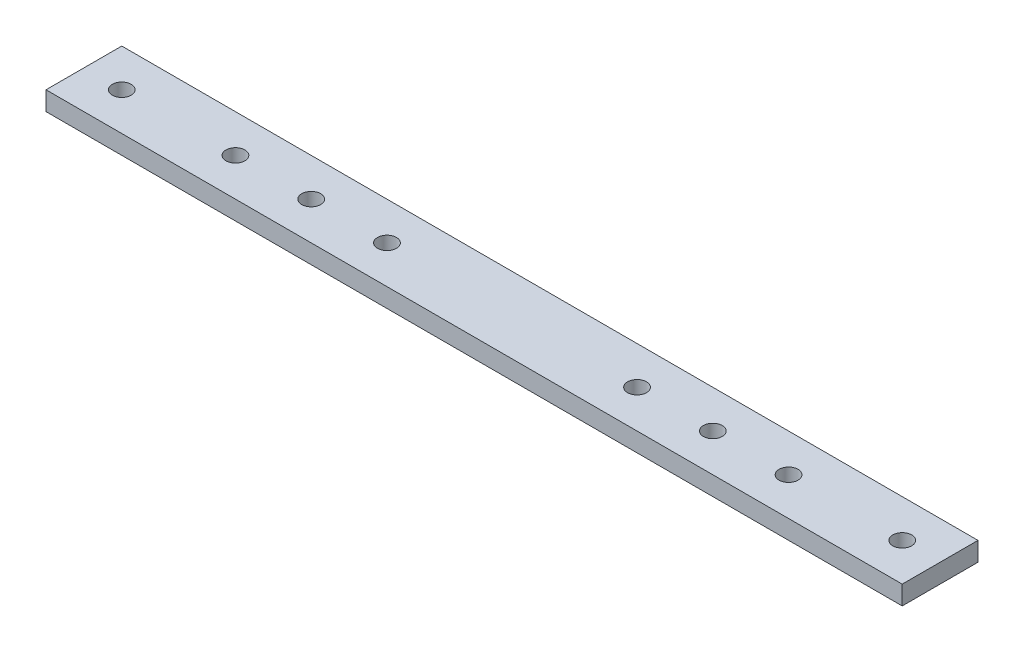
ISO-10303-21;
HEADER;
FILE_DESCRIPTION(('STEP AP214'),'2;1');
FILE_NAME('part.step','',(''),(''),'','','');
FILE_SCHEMA(('AUTOMOTIVE_DESIGN { 1 0 10303 214 1 1 1 1 }'));
ENDSEC;
DATA;
#1=APPLICATION_CONTEXT('core data for automotive mechanical design processes');
#2=APPLICATION_PROTOCOL_DEFINITION('international standard','automotive_design',2000,#1);
#3=PRODUCT_CONTEXT('',#1,'mechanical');
#4=PRODUCT('Part','Part','',(#3));
#5=PRODUCT_RELATED_PRODUCT_CATEGORY('part','',(#4));
#6=PRODUCT_DEFINITION_FORMATION('','',#4);
#7=PRODUCT_DEFINITION_CONTEXT('part definition',#1,'design');
#8=PRODUCT_DEFINITION('design','',#6,#7);
#9=PRODUCT_DEFINITION_SHAPE('','',#8);
#10=(LENGTH_UNIT() NAMED_UNIT(*) SI_UNIT(.MILLI.,.METRE.));
#11=(NAMED_UNIT(*) PLANE_ANGLE_UNIT() SI_UNIT($,.RADIAN.));
#12=(NAMED_UNIT(*) SI_UNIT($,.STERADIAN.) SOLID_ANGLE_UNIT());
#13=UNCERTAINTY_MEASURE_WITH_UNIT(LENGTH_MEASURE(1.E-05),#10,'distance_accuracy_value','');
#14=(GEOMETRIC_REPRESENTATION_CONTEXT(3) GLOBAL_UNCERTAINTY_ASSIGNED_CONTEXT((#13)) GLOBAL_UNIT_ASSIGNED_CONTEXT((#10,
#11,#12)) REPRESENTATION_CONTEXT('',''));
#15=CARTESIAN_POINT('',(0.,0.,0.));
#16=DIRECTION('',(0.,0.,1.));
#17=DIRECTION('',(1.,0.,0.));
#18=AXIS2_PLACEMENT_3D('',#15,#16,#17);
#19=CARTESIAN_POINT('',(143.51,3.175,-12.7));
#20=DIRECTION('',(-1.,0.,0.));
#21=DIRECTION('',(0.,0.,1.));
#22=AXIS2_PLACEMENT_3D('',#19,#20,#21);
#23=PLANE('',#22);
#24=DIRECTION('',(0.,0.,-1.));
#25=VECTOR('',#24,1.);
#26=CARTESIAN_POINT('',(143.51,-3.175,-12.7));
#27=LINE('',#26,#25);
#28=CARTESIAN_POINT('',(143.51,-3.175,12.7));
#29=VERTEX_POINT('',#28);
#30=CARTESIAN_POINT('',(143.51,-3.175,-12.7));
#31=VERTEX_POINT('',#30);
#32=EDGE_CURVE('E96',#29,#31,#27,.T.);
#33=ORIENTED_EDGE('',*,*,#32,.T.);
#34=DIRECTION('',(0.,-1.,0.));
#35=VECTOR('',#34,1.);
#36=CARTESIAN_POINT('',(143.51,3.175,-12.7));
#37=LINE('',#36,#35);
#38=CARTESIAN_POINT('',(143.51,3.175,-12.7));
#39=VERTEX_POINT('',#38);
#40=EDGE_CURVE('E11',#39,#31,#37,.T.);
#41=ORIENTED_EDGE('',*,*,#40,.F.);
#42=DIRECTION('',(0.,0.,-1.));
#43=VECTOR('',#42,1.);
#44=CARTESIAN_POINT('',(143.51,3.175,-12.7));
#45=LINE('',#44,#43);
#46=CARTESIAN_POINT('',(143.51,3.175,12.7));
#47=VERTEX_POINT('',#46);
#48=EDGE_CURVE('E84',#47,#39,#45,.T.);
#49=ORIENTED_EDGE('',*,*,#48,.F.);
#50=DIRECTION('',(0.,-1.,0.));
#51=VECTOR('',#50,1.);
#52=CARTESIAN_POINT('',(143.51,3.175,12.7));
#53=LINE('',#52,#51);
#54=EDGE_CURVE('E92',#47,#29,#53,.T.);
#55=ORIENTED_EDGE('',*,*,#54,.T.);
#56=EDGE_LOOP('',(#33,#41,#49,#55));
#57=FACE_BOUND('',#56,.T.);
#58=ADVANCED_FACE('F33',(#57),#23,.F.);
#59=CARTESIAN_POINT('',(-143.51,3.175,-12.7));
#60=DIRECTION('',(0.,0.,1.));
#61=DIRECTION('',(1.,0.,0.));
#62=AXIS2_PLACEMENT_3D('',#59,#60,#61);
#63=PLANE('',#62);
#64=DIRECTION('',(-1.,0.,0.));
#65=VECTOR('',#64,1.);
#66=CARTESIAN_POINT('',(-143.51,-3.175,-12.7));
#67=LINE('',#66,#65);
#68=CARTESIAN_POINT('',(-143.51,-3.175,-12.7));
#69=VERTEX_POINT('',#68);
#70=EDGE_CURVE('E88',#31,#69,#67,.T.);
#71=ORIENTED_EDGE('',*,*,#70,.T.);
#72=DIRECTION('',(0.,-1.,0.));
#73=VECTOR('',#72,1.);
#74=CARTESIAN_POINT('',(-143.51,3.175,-12.7));
#75=LINE('',#74,#73);
#76=CARTESIAN_POINT('',(-143.51,3.175,-12.7));
#77=VERTEX_POINT('',#76);
#78=EDGE_CURVE('E41',#77,#69,#75,.T.);
#79=ORIENTED_EDGE('',*,*,#78,.F.);
#80=DIRECTION('',(-1.,0.,0.));
#81=VECTOR('',#80,1.);
#82=CARTESIAN_POINT('',(-143.51,3.175,-12.7));
#83=LINE('',#82,#81);
#84=EDGE_CURVE('E79',#39,#77,#83,.T.);
#85=ORIENTED_EDGE('',*,*,#84,.F.);
#86=ORIENTED_EDGE('',*,*,#40,.T.);
#87=EDGE_LOOP('',(#71,#79,#85,#86));
#88=FACE_BOUND('',#87,.T.);
#89=ADVANCED_FACE('F87',(#88),#63,.F.);
#90=CARTESIAN_POINT('',(-143.51,3.175,-12.7));
#91=DIRECTION('',(1.,0.,0.));
#92=DIRECTION('',(0.,0.,-1.));
#93=AXIS2_PLACEMENT_3D('',#90,#91,#92);
#94=PLANE('',#93);
#95=DIRECTION('',(0.,0.,1.));
#96=VECTOR('',#95,1.);
#97=CARTESIAN_POINT('',(-143.51,-3.175,-12.7));
#98=LINE('',#97,#96);
#99=CARTESIAN_POINT('',(-143.51,-3.175,12.7));
#100=VERTEX_POINT('',#99);
#101=EDGE_CURVE('E66',#69,#100,#98,.T.);
#102=ORIENTED_EDGE('',*,*,#101,.T.);
#103=DIRECTION('',(0.,-1.,0.));
#104=VECTOR('',#103,1.);
#105=CARTESIAN_POINT('',(-143.51,3.175,12.7));
#106=LINE('',#105,#104);
#107=CARTESIAN_POINT('',(-143.51,3.175,12.7));
#108=VERTEX_POINT('',#107);
#109=EDGE_CURVE('E89',#108,#100,#106,.T.);
#110=ORIENTED_EDGE('',*,*,#109,.F.);
#111=DIRECTION('',(0.,0.,1.));
#112=VECTOR('',#111,1.);
#113=CARTESIAN_POINT('',(-143.51,3.175,-12.7));
#114=LINE('',#113,#112);
#115=EDGE_CURVE('E82',#77,#108,#114,.T.);
#116=ORIENTED_EDGE('',*,*,#115,.F.);
#117=ORIENTED_EDGE('',*,*,#78,.T.);
#118=EDGE_LOOP('',(#102,#110,#116,#117));
#119=FACE_BOUND('',#118,.T.);
#120=ADVANCED_FACE('F90',(#119),#94,.F.);
#121=CARTESIAN_POINT('',(-143.51,3.175,12.7));
#122=DIRECTION('',(0.,0.,-1.));
#123=DIRECTION('',(-1.,0.,0.));
#124=AXIS2_PLACEMENT_3D('',#121,#122,#123);
#125=PLANE('',#124);
#126=DIRECTION('',(1.,0.,0.));
#127=VECTOR('',#126,1.);
#128=CARTESIAN_POINT('',(-143.51,-3.175,12.7));
#129=LINE('',#128,#127);
#130=EDGE_CURVE('E72',#100,#29,#129,.T.);
#131=ORIENTED_EDGE('',*,*,#130,.T.);
#132=ORIENTED_EDGE('',*,*,#54,.F.);
#133=DIRECTION('',(1.,0.,0.));
#134=VECTOR('',#133,1.);
#135=CARTESIAN_POINT('',(-143.51,3.175,12.7));
#136=LINE('',#135,#134);
#137=EDGE_CURVE('E49',#108,#47,#136,.T.);
#138=ORIENTED_EDGE('',*,*,#137,.F.);
#139=ORIENTED_EDGE('',*,*,#109,.T.);
#140=EDGE_LOOP('',(#131,#132,#138,#139));
#141=FACE_BOUND('',#140,.T.);
#142=ADVANCED_FACE('F104',(#141),#125,.F.);
#143=CARTESIAN_POINT('',(0.,3.175,0.));
#144=DIRECTION('',(0.,1.,0.));
#145=DIRECTION('',(0.,0.,1.));
#146=AXIS2_PLACEMENT_3D('',#143,#144,#145);
#147=PLANE('',#146);
#148=CARTESIAN_POINT('',(-130.81,3.175,0.));
#149=DIRECTION('',(0.,1.,0.));
#150=DIRECTION('',(0.,0.,1.));
#151=AXIS2_PLACEMENT_3D('',#148,#149,#150);
#152=CIRCLE('',#151,3.175);
#153=CARTESIAN_POINT('',(-130.81,3.175,3.175));
#154=VERTEX_POINT('',#153);
#155=EDGE_CURVE('E99',#154,#154,#152,.T.);
#156=ORIENTED_EDGE('',*,*,#155,.F.);
#157=EDGE_LOOP('',(#156));
#158=FACE_BOUND('',#157,.T.);
#159=CARTESIAN_POINT('',(92.71,3.175,0.));
#160=DIRECTION('',(0.,1.,0.));
#161=DIRECTION('',(0.,0.,1.));
#162=AXIS2_PLACEMENT_3D('',#159,#160,#161);
#163=CIRCLE('',#162,3.175);
#164=CARTESIAN_POINT('',(92.71,3.175,3.175));
#165=VERTEX_POINT('',#164);
#166=EDGE_CURVE('E112',#165,#165,#163,.T.);
#167=ORIENTED_EDGE('',*,*,#166,.F.);
#168=EDGE_LOOP('',(#167));
#169=FACE_BOUND('',#168,.T.);
#170=CARTESIAN_POINT('',(67.31,3.175,0.));
#171=DIRECTION('',(0.,1.,0.));
#172=DIRECTION('',(0.,0.,1.));
#173=AXIS2_PLACEMENT_3D('',#170,#171,#172);
#174=CIRCLE('',#173,3.17500000000003);
#175=CARTESIAN_POINT('',(67.31,3.175,3.17500000000003));
#176=VERTEX_POINT('',#175);
#177=EDGE_CURVE('E115',#176,#176,#174,.T.);
#178=ORIENTED_EDGE('',*,*,#177,.F.);
#179=EDGE_LOOP('',(#178));
#180=FACE_BOUND('',#179,.T.);
#181=CARTESIAN_POINT('',(-67.31,3.175,0.));
#182=DIRECTION('',(0.,1.,0.));
#183=DIRECTION('',(0.,0.,1.));
#184=AXIS2_PLACEMENT_3D('',#181,#182,#183);
#185=CIRCLE('',#184,3.175);
#186=CARTESIAN_POINT('',(-67.31,3.175,3.175));
#187=VERTEX_POINT('',#186);
#188=EDGE_CURVE('E118',#187,#187,#185,.T.);
#189=ORIENTED_EDGE('',*,*,#188,.F.);
#190=EDGE_LOOP('',(#189));
#191=FACE_BOUND('',#190,.T.);
#192=CARTESIAN_POINT('',(41.91,3.175,0.));
#193=DIRECTION('',(0.,1.,0.));
#194=DIRECTION('',(0.,0.,1.));
#195=AXIS2_PLACEMENT_3D('',#192,#193,#194);
#196=CIRCLE('',#195,3.175);
#197=CARTESIAN_POINT('',(41.91,3.175,3.175));
#198=VERTEX_POINT('',#197);
#199=EDGE_CURVE('E121',#198,#198,#196,.T.);
#200=ORIENTED_EDGE('',*,*,#199,.F.);
#201=EDGE_LOOP('',(#200));
#202=FACE_BOUND('',#201,.T.);
#203=CARTESIAN_POINT('',(130.81,3.175,0.));
#204=DIRECTION('',(0.,1.,0.));
#205=DIRECTION('',(0.,0.,1.));
#206=AXIS2_PLACEMENT_3D('',#203,#204,#205);
#207=CIRCLE('',#206,3.175);
#208=CARTESIAN_POINT('',(130.81,3.175,3.175));
#209=VERTEX_POINT('',#208);
#210=EDGE_CURVE('E124',#209,#209,#207,.T.);
#211=ORIENTED_EDGE('',*,*,#210,.F.);
#212=EDGE_LOOP('',(#211));
#213=FACE_BOUND('',#212,.T.);
#214=CARTESIAN_POINT('',(-92.71,3.175,0.));
#215=DIRECTION('',(0.,1.,0.));
#216=DIRECTION('',(0.,0.,1.));
#217=AXIS2_PLACEMENT_3D('',#214,#215,#216);
#218=CIRCLE('',#217,3.175);
#219=CARTESIAN_POINT('',(-92.71,3.175,3.175));
#220=VERTEX_POINT('',#219);
#221=EDGE_CURVE('E127',#220,#220,#218,.T.);
#222=ORIENTED_EDGE('',*,*,#221,.F.);
#223=EDGE_LOOP('',(#222));
#224=FACE_BOUND('',#223,.T.);
#225=CARTESIAN_POINT('',(-41.91,3.175,0.));
#226=DIRECTION('',(0.,1.,0.));
#227=DIRECTION('',(0.,0.,1.));
#228=AXIS2_PLACEMENT_3D('',#225,#226,#227);
#229=CIRCLE('',#228,3.175);
#230=CARTESIAN_POINT('',(-41.91,3.175,3.175));
#231=VERTEX_POINT('',#230);
#232=EDGE_CURVE('E130',#231,#231,#229,.T.);
#233=ORIENTED_EDGE('',*,*,#232,.F.);
#234=EDGE_LOOP('',(#233));
#235=FACE_BOUND('',#234,.T.);
#236=ORIENTED_EDGE('',*,*,#48,.T.);
#237=ORIENTED_EDGE('',*,*,#84,.T.);
#238=ORIENTED_EDGE('',*,*,#115,.T.);
#239=ORIENTED_EDGE('',*,*,#137,.T.);
#240=EDGE_LOOP('',(#236,#237,#238,#239));
#241=FACE_BOUND('',#240,.T.);
#242=ADVANCED_FACE('F80',(#158,#169,#180,#191,#202,#213,#224,#235,#241),#147,.T.);
#243=CARTESIAN_POINT('',(0.,-3.175,0.));
#244=DIRECTION('',(0.,1.,0.));
#245=DIRECTION('',(0.,0.,1.));
#246=AXIS2_PLACEMENT_3D('',#243,#244,#245);
#247=PLANE('',#246);
#248=CARTESIAN_POINT('',(-130.81,-3.175,0.));
#249=DIRECTION('',(0.,1.,0.));
#250=DIRECTION('',(0.,0.,1.));
#251=AXIS2_PLACEMENT_3D('',#248,#249,#250);
#252=CIRCLE('',#251,3.175);
#253=CARTESIAN_POINT('',(-130.81,-3.175,3.175));
#254=VERTEX_POINT('',#253);
#255=EDGE_CURVE('E133',#254,#254,#252,.T.);
#256=ORIENTED_EDGE('',*,*,#255,.T.);
#257=EDGE_LOOP('',(#256));
#258=FACE_BOUND('',#257,.T.);
#259=CARTESIAN_POINT('',(92.71,-3.175,0.));
#260=DIRECTION('',(0.,1.,0.));
#261=DIRECTION('',(0.,0.,-1.));
#262=AXIS2_PLACEMENT_3D('',#259,#260,#261);
#263=CIRCLE('',#262,3.175);
#264=CARTESIAN_POINT('',(92.71,-3.175,-3.175));
#265=VERTEX_POINT('',#264);
#266=EDGE_CURVE('E147',#265,#265,#263,.T.);
#267=ORIENTED_EDGE('',*,*,#266,.T.);
#268=EDGE_LOOP('',(#267));
#269=FACE_BOUND('',#268,.T.);
#270=CARTESIAN_POINT('',(67.31,-3.175,0.));
#271=DIRECTION('',(0.,1.,0.));
#272=DIRECTION('',(0.,0.,-1.));
#273=AXIS2_PLACEMENT_3D('',#270,#271,#272);
#274=CIRCLE('',#273,3.17500000000003);
#275=CARTESIAN_POINT('',(67.31,-3.175,-3.17500000000003));
#276=VERTEX_POINT('',#275);
#277=EDGE_CURVE('E150',#276,#276,#274,.T.);
#278=ORIENTED_EDGE('',*,*,#277,.T.);
#279=EDGE_LOOP('',(#278));
#280=FACE_BOUND('',#279,.T.);
#281=CARTESIAN_POINT('',(-67.31,-3.175,0.));
#282=DIRECTION('',(0.,1.,0.));
#283=DIRECTION('',(0.,0.,1.));
#284=AXIS2_PLACEMENT_3D('',#281,#282,#283);
#285=CIRCLE('',#284,3.175);
#286=CARTESIAN_POINT('',(-67.31,-3.175,3.175));
#287=VERTEX_POINT('',#286);
#288=EDGE_CURVE('E138',#287,#287,#285,.T.);
#289=ORIENTED_EDGE('',*,*,#288,.T.);
#290=EDGE_LOOP('',(#289));
#291=FACE_BOUND('',#290,.T.);
#292=CARTESIAN_POINT('',(41.91,-3.175,0.));
#293=DIRECTION('',(0.,1.,0.));
#294=DIRECTION('',(0.,0.,-1.));
#295=AXIS2_PLACEMENT_3D('',#292,#293,#294);
#296=CIRCLE('',#295,3.175);
#297=CARTESIAN_POINT('',(41.91,-3.175,-3.175));
#298=VERTEX_POINT('',#297);
#299=EDGE_CURVE('E134',#298,#298,#296,.T.);
#300=ORIENTED_EDGE('',*,*,#299,.T.);
#301=EDGE_LOOP('',(#300));
#302=FACE_BOUND('',#301,.T.);
#303=CARTESIAN_POINT('',(130.81,-3.175,0.));
#304=DIRECTION('',(0.,1.,0.));
#305=DIRECTION('',(0.,0.,-1.));
#306=AXIS2_PLACEMENT_3D('',#303,#304,#305);
#307=CIRCLE('',#306,3.175);
#308=CARTESIAN_POINT('',(130.81,-3.175,-3.175));
#309=VERTEX_POINT('',#308);
#310=EDGE_CURVE('E137',#309,#309,#307,.T.);
#311=ORIENTED_EDGE('',*,*,#310,.T.);
#312=EDGE_LOOP('',(#311));
#313=FACE_BOUND('',#312,.T.);
#314=CARTESIAN_POINT('',(-92.71,-3.175,0.));
#315=DIRECTION('',(0.,1.,0.));
#316=DIRECTION('',(0.,0.,1.));
#317=AXIS2_PLACEMENT_3D('',#314,#315,#316);
#318=CIRCLE('',#317,3.175);
#319=CARTESIAN_POINT('',(-92.71,-3.175,3.175));
#320=VERTEX_POINT('',#319);
#321=EDGE_CURVE('E141',#320,#320,#318,.T.);
#322=ORIENTED_EDGE('',*,*,#321,.T.);
#323=EDGE_LOOP('',(#322));
#324=FACE_BOUND('',#323,.T.);
#325=CARTESIAN_POINT('',(-41.91,-3.175,0.));
#326=DIRECTION('',(0.,1.,0.));
#327=DIRECTION('',(0.,0.,1.));
#328=AXIS2_PLACEMENT_3D('',#325,#326,#327);
#329=CIRCLE('',#328,3.175);
#330=CARTESIAN_POINT('',(-41.91,-3.175,3.175));
#331=VERTEX_POINT('',#330);
#332=EDGE_CURVE('E144',#331,#331,#329,.T.);
#333=ORIENTED_EDGE('',*,*,#332,.T.);
#334=EDGE_LOOP('',(#333));
#335=FACE_BOUND('',#334,.T.);
#336=ORIENTED_EDGE('',*,*,#32,.F.);
#337=ORIENTED_EDGE('',*,*,#130,.F.);
#338=ORIENTED_EDGE('',*,*,#101,.F.);
#339=ORIENTED_EDGE('',*,*,#70,.F.);
#340=EDGE_LOOP('',(#336,#337,#338,#339));
#341=FACE_BOUND('',#340,.T.);
#342=ADVANCED_FACE('F107',(#258,#269,#280,#291,#302,#313,#324,#335,#341),#247,.F.);
#343=CARTESIAN_POINT('',(-41.91,-3.175,0.));
#344=DIRECTION('',(0.,1.,0.));
#345=DIRECTION('',(0.,0.,1.));
#346=AXIS2_PLACEMENT_3D('',#343,#344,#345);
#347=CYLINDRICAL_SURFACE('',#346,3.175);
#348=ORIENTED_EDGE('',*,*,#232,.T.);
#349=EDGE_LOOP('',(#348));
#350=FACE_BOUND('',#349,.T.);
#351=ORIENTED_EDGE('',*,*,#332,.F.);
#352=EDGE_LOOP('',(#351));
#353=FACE_BOUND('',#352,.T.);
#354=ADVANCED_FACE('F185',(#350,#353),#347,.F.);
#355=CARTESIAN_POINT('',(-92.71,-3.175,0.));
#356=DIRECTION('',(0.,1.,0.));
#357=DIRECTION('',(0.,0.,1.));
#358=AXIS2_PLACEMENT_3D('',#355,#356,#357);
#359=CYLINDRICAL_SURFACE('',#358,3.175);
#360=ORIENTED_EDGE('',*,*,#221,.T.);
#361=EDGE_LOOP('',(#360));
#362=FACE_BOUND('',#361,.T.);
#363=ORIENTED_EDGE('',*,*,#321,.F.);
#364=EDGE_LOOP('',(#363));
#365=FACE_BOUND('',#364,.T.);
#366=ADVANCED_FACE('F197',(#362,#365),#359,.F.);
#367=CARTESIAN_POINT('',(130.81,-3.175,0.));
#368=DIRECTION('',(0.,1.,0.));
#369=DIRECTION('',(0.,0.,1.));
#370=AXIS2_PLACEMENT_3D('',#367,#368,#369);
#371=CYLINDRICAL_SURFACE('',#370,3.175);
#372=ORIENTED_EDGE('',*,*,#210,.T.);
#373=EDGE_LOOP('',(#372));
#374=FACE_BOUND('',#373,.T.);
#375=ORIENTED_EDGE('',*,*,#310,.F.);
#376=EDGE_LOOP('',(#375));
#377=FACE_BOUND('',#376,.T.);
#378=ADVANCED_FACE('F193',(#374,#377),#371,.F.);
#379=CARTESIAN_POINT('',(41.91,-3.175,0.));
#380=DIRECTION('',(0.,1.,0.));
#381=DIRECTION('',(0.,0.,1.));
#382=AXIS2_PLACEMENT_3D('',#379,#380,#381);
#383=CYLINDRICAL_SURFACE('',#382,3.175);
#384=ORIENTED_EDGE('',*,*,#199,.T.);
#385=EDGE_LOOP('',(#384));
#386=FACE_BOUND('',#385,.T.);
#387=ORIENTED_EDGE('',*,*,#299,.F.);
#388=EDGE_LOOP('',(#387));
#389=FACE_BOUND('',#388,.T.);
#390=ADVANCED_FACE('F189',(#386,#389),#383,.F.);
#391=CARTESIAN_POINT('',(-67.31,-3.175,0.));
#392=DIRECTION('',(0.,1.,0.));
#393=DIRECTION('',(0.,0.,1.));
#394=AXIS2_PLACEMENT_3D('',#391,#392,#393);
#395=CYLINDRICAL_SURFACE('',#394,3.175);
#396=ORIENTED_EDGE('',*,*,#188,.T.);
#397=EDGE_LOOP('',(#396));
#398=FACE_BOUND('',#397,.T.);
#399=ORIENTED_EDGE('',*,*,#288,.F.);
#400=EDGE_LOOP('',(#399));
#401=FACE_BOUND('',#400,.T.);
#402=ADVANCED_FACE('F192',(#398,#401),#395,.F.);
#403=CARTESIAN_POINT('',(67.31,-3.175,0.));
#404=DIRECTION('',(0.,1.,0.));
#405=DIRECTION('',(0.,0.,1.));
#406=AXIS2_PLACEMENT_3D('',#403,#404,#405);
#407=CYLINDRICAL_SURFACE('',#406,3.17500000000003);
#408=ORIENTED_EDGE('',*,*,#177,.T.);
#409=EDGE_LOOP('',(#408));
#410=FACE_BOUND('',#409,.T.);
#411=ORIENTED_EDGE('',*,*,#277,.F.);
#412=EDGE_LOOP('',(#411));
#413=FACE_BOUND('',#412,.T.);
#414=ADVANCED_FACE('F168',(#410,#413),#407,.F.);
#415=CARTESIAN_POINT('',(92.71,-3.175,0.));
#416=DIRECTION('',(0.,1.,0.));
#417=DIRECTION('',(0.,0.,1.));
#418=AXIS2_PLACEMENT_3D('',#415,#416,#417);
#419=CYLINDRICAL_SURFACE('',#418,3.175);
#420=ORIENTED_EDGE('',*,*,#166,.T.);
#421=EDGE_LOOP('',(#420));
#422=FACE_BOUND('',#421,.T.);
#423=ORIENTED_EDGE('',*,*,#266,.F.);
#424=EDGE_LOOP('',(#423));
#425=FACE_BOUND('',#424,.T.);
#426=ADVANCED_FACE('F162',(#422,#425),#419,.F.);
#427=CARTESIAN_POINT('',(-130.81,-3.175,0.));
#428=DIRECTION('',(0.,1.,0.));
#429=DIRECTION('',(0.,0.,1.));
#430=AXIS2_PLACEMENT_3D('',#427,#428,#429);
#431=CYLINDRICAL_SURFACE('',#430,3.175);
#432=ORIENTED_EDGE('',*,*,#155,.T.);
#433=EDGE_LOOP('',(#432));
#434=FACE_BOUND('',#433,.T.);
#435=ORIENTED_EDGE('',*,*,#255,.F.);
#436=EDGE_LOOP('',(#435));
#437=FACE_BOUND('',#436,.T.);
#438=ADVANCED_FACE('F160',(#434,#437),#431,.F.);
#439=CLOSED_SHELL('',(#58,#89,#120,#142,#242,#342,#354,#366,#378,#390,#402,#414,#426,#438));
#440=MANIFOLD_SOLID_BREP('B2',#439);
#441=ADVANCED_BREP_SHAPE_REPRESENTATION('',(#18,#440),#14);
#442=SHAPE_DEFINITION_REPRESENTATION(#9,#441);
ENDSEC;
END-ISO-10303-21;
